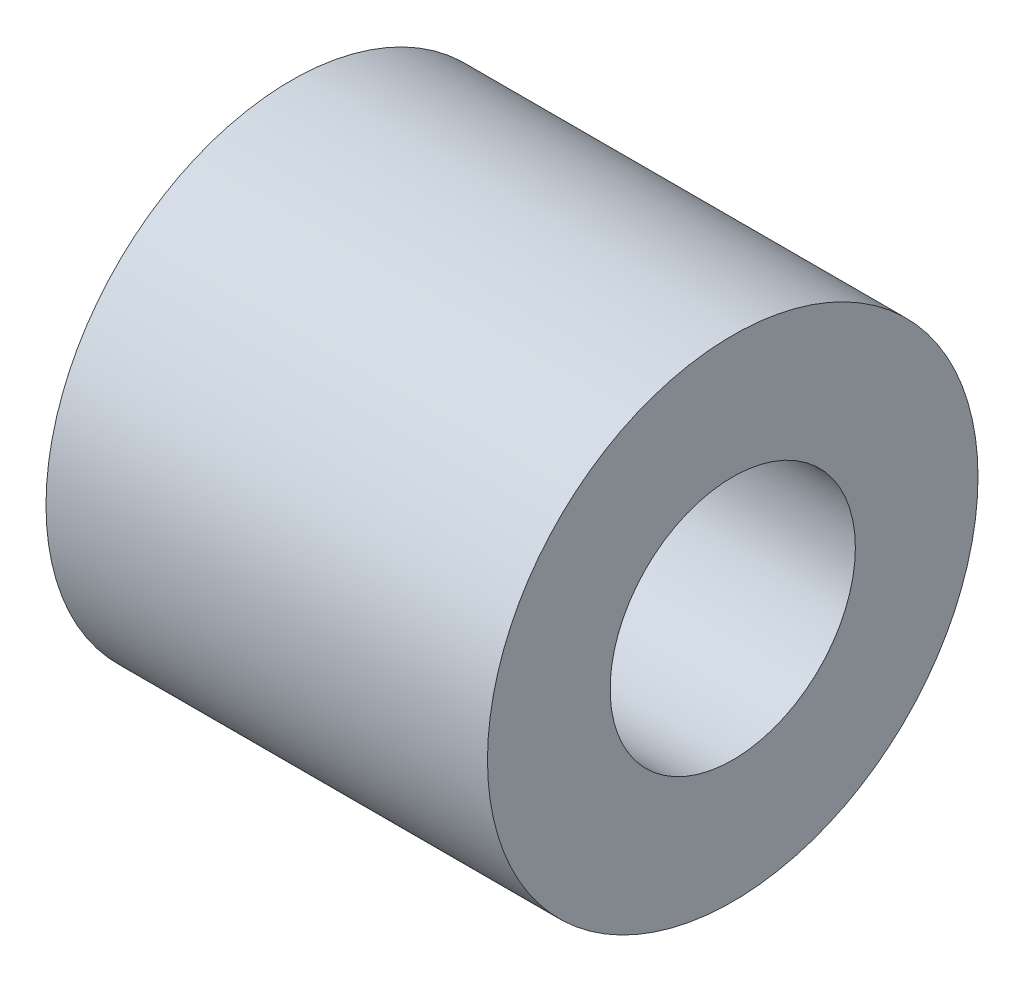
ISO-10303-21;
HEADER;
FILE_DESCRIPTION(('STEP AP214'),'2;1');
FILE_NAME('part.step','',(''),(''),'','','');
FILE_SCHEMA(('AUTOMOTIVE_DESIGN { 1 0 10303 214 1 1 1 1 }'));
ENDSEC;
DATA;
#1=APPLICATION_CONTEXT('core data for automotive mechanical design processes');
#2=APPLICATION_PROTOCOL_DEFINITION('international standard','automotive_design',2000,#1);
#3=PRODUCT_CONTEXT('',#1,'mechanical');
#4=PRODUCT('Part','Part','',(#3));
#5=PRODUCT_RELATED_PRODUCT_CATEGORY('part','',(#4));
#6=PRODUCT_DEFINITION_FORMATION('','',#4);
#7=PRODUCT_DEFINITION_CONTEXT('part definition',#1,'design');
#8=PRODUCT_DEFINITION('design','',#6,#7);
#9=PRODUCT_DEFINITION_SHAPE('','',#8);
#10=(LENGTH_UNIT() NAMED_UNIT(*) SI_UNIT(.MILLI.,.METRE.));
#11=(NAMED_UNIT(*) PLANE_ANGLE_UNIT() SI_UNIT($,.RADIAN.));
#12=(NAMED_UNIT(*) SI_UNIT($,.STERADIAN.) SOLID_ANGLE_UNIT());
#13=UNCERTAINTY_MEASURE_WITH_UNIT(LENGTH_MEASURE(1.E-05),#10,'distance_accuracy_value','');
#14=(GEOMETRIC_REPRESENTATION_CONTEXT(3) GLOBAL_UNCERTAINTY_ASSIGNED_CONTEXT((#13)) GLOBAL_UNIT_ASSIGNED_CONTEXT((#10,
#11,#12)) REPRESENTATION_CONTEXT('',''));
#15=CARTESIAN_POINT('',(0.,0.,0.));
#16=DIRECTION('',(0.,0.,1.));
#17=DIRECTION('',(1.,0.,0.));
#18=AXIS2_PLACEMENT_3D('',#15,#16,#17);
#19=CARTESIAN_POINT('',(9.,0.,0.));
#20=DIRECTION('',(1.,0.,0.));
#21=DIRECTION('',(0.,0.,-1.));
#22=AXIS2_PLACEMENT_3D('',#19,#20,#21);
#23=PLANE('',#22);
#24=CARTESIAN_POINT('',(9.,0.,0.));
#25=DIRECTION('',(1.,0.,0.));
#26=DIRECTION('',(0.,0.,-1.));
#27=AXIS2_PLACEMENT_3D('',#24,#25,#26);
#28=CIRCLE('',#27,5.);
#29=CARTESIAN_POINT('',(9.,0.,-5.));
#30=VERTEX_POINT('',#29);
#31=EDGE_CURVE('E10',#30,#30,#28,.T.);
#32=ORIENTED_EDGE('',*,*,#31,.T.);
#33=EDGE_LOOP('',(#32));
#34=FACE_BOUND('',#33,.T.);
#35=CARTESIAN_POINT('',(9.,0.,0.));
#36=DIRECTION('',(1.,0.,0.));
#37=DIRECTION('',(0.,0.,-1.));
#38=AXIS2_PLACEMENT_3D('',#35,#36,#37);
#39=CIRCLE('',#38,2.5);
#40=CARTESIAN_POINT('',(9.,0.,-2.5));
#41=VERTEX_POINT('',#40);
#42=EDGE_CURVE('E41',#41,#41,#39,.T.);
#43=ORIENTED_EDGE('',*,*,#42,.F.);
#44=EDGE_LOOP('',(#43));
#45=FACE_BOUND('',#44,.T.);
#46=ADVANCED_FACE('F30',(#34,#45),#23,.T.);
#47=CARTESIAN_POINT('',(0.,0.,0.));
#48=DIRECTION('',(1.,0.,0.));
#49=DIRECTION('',(0.,0.,-1.));
#50=AXIS2_PLACEMENT_3D('',#47,#48,#49);
#51=PLANE('',#50);
#52=CARTESIAN_POINT('',(0.,0.,0.));
#53=DIRECTION('',(1.,0.,0.));
#54=DIRECTION('',(0.,0.,-1.));
#55=AXIS2_PLACEMENT_3D('',#52,#53,#54);
#56=CIRCLE('',#55,5.);
#57=CARTESIAN_POINT('',(0.,0.,-5.));
#58=VERTEX_POINT('',#57);
#59=EDGE_CURVE('E34',#58,#58,#56,.T.);
#60=ORIENTED_EDGE('',*,*,#59,.F.);
#61=EDGE_LOOP('',(#60));
#62=FACE_BOUND('',#61,.T.);
#63=CARTESIAN_POINT('',(0.,0.,0.));
#64=DIRECTION('',(1.,0.,0.));
#65=DIRECTION('',(0.,0.,-1.));
#66=AXIS2_PLACEMENT_3D('',#63,#64,#65);
#67=CIRCLE('',#66,2.5);
#68=CARTESIAN_POINT('',(0.,0.,-2.5));
#69=VERTEX_POINT('',#68);
#70=EDGE_CURVE('E43',#69,#69,#67,.T.);
#71=ORIENTED_EDGE('',*,*,#70,.T.);
#72=EDGE_LOOP('',(#71));
#73=FACE_BOUND('',#72,.T.);
#74=ADVANCED_FACE('F53',(#62,#73),#51,.F.);
#75=CARTESIAN_POINT('',(9.,0.,0.));
#76=DIRECTION('',(-1.,0.,0.));
#77=DIRECTION('',(0.,0.,1.));
#78=AXIS2_PLACEMENT_3D('',#75,#76,#77);
#79=CYLINDRICAL_SURFACE('',#78,5.);
#80=ORIENTED_EDGE('',*,*,#31,.F.);
#81=EDGE_LOOP('',(#80));
#82=FACE_BOUND('',#81,.T.);
#83=ORIENTED_EDGE('',*,*,#59,.T.);
#84=EDGE_LOOP('',(#83));
#85=FACE_BOUND('',#84,.T.);
#86=ADVANCED_FACE('F32',(#82,#85),#79,.T.);
#87=CARTESIAN_POINT('',(9.,0.,0.));
#88=DIRECTION('',(-1.,0.,0.));
#89=DIRECTION('',(0.,0.,1.));
#90=AXIS2_PLACEMENT_3D('',#87,#88,#89);
#91=CYLINDRICAL_SURFACE('',#90,2.5);
#92=ORIENTED_EDGE('',*,*,#42,.T.);
#93=EDGE_LOOP('',(#92));
#94=FACE_BOUND('',#93,.T.);
#95=ORIENTED_EDGE('',*,*,#70,.F.);
#96=EDGE_LOOP('',(#95));
#97=FACE_BOUND('',#96,.T.);
#98=ADVANCED_FACE('F49',(#94,#97),#91,.F.);
#99=CLOSED_SHELL('',(#46,#74,#86,#98));
#100=MANIFOLD_SOLID_BREP('B2',#99);
#101=ADVANCED_BREP_SHAPE_REPRESENTATION('',(#18,#100),#14);
#102=SHAPE_DEFINITION_REPRESENTATION(#9,#101);
ENDSEC;
END-ISO-10303-21;
